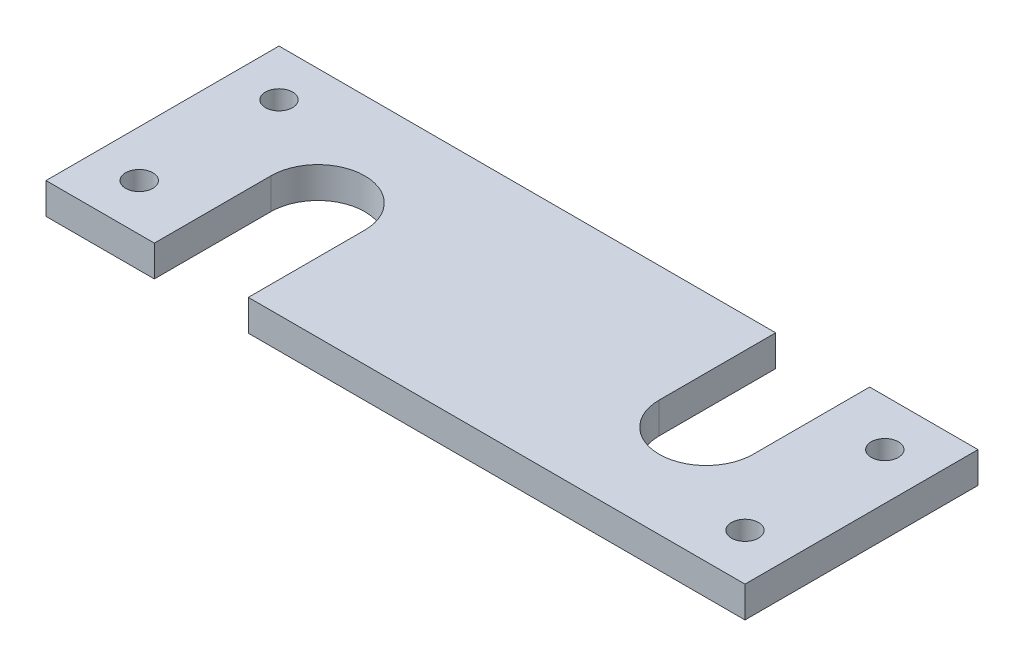
ISO-10303-21;
HEADER;
FILE_DESCRIPTION(('STEP AP214'),'2;1');
FILE_NAME('part.step','',(''),(''),'','','');
FILE_SCHEMA(('AUTOMOTIVE_DESIGN { 1 0 10303 214 1 1 1 1 }'));
ENDSEC;
DATA;
#1=APPLICATION_CONTEXT('core data for automotive mechanical design processes');
#2=APPLICATION_PROTOCOL_DEFINITION('international standard','automotive_design',2000,#1);
#3=PRODUCT_CONTEXT('',#1,'mechanical');
#4=PRODUCT('Part','Part','',(#3));
#5=PRODUCT_RELATED_PRODUCT_CATEGORY('part','',(#4));
#6=PRODUCT_DEFINITION_FORMATION('','',#4);
#7=PRODUCT_DEFINITION_CONTEXT('part definition',#1,'design');
#8=PRODUCT_DEFINITION('design','',#6,#7);
#9=PRODUCT_DEFINITION_SHAPE('','',#8);
#10=(LENGTH_UNIT() NAMED_UNIT(*) SI_UNIT(.MILLI.,.METRE.));
#11=(NAMED_UNIT(*) PLANE_ANGLE_UNIT() SI_UNIT($,.RADIAN.));
#12=(NAMED_UNIT(*) SI_UNIT($,.STERADIAN.) SOLID_ANGLE_UNIT());
#13=UNCERTAINTY_MEASURE_WITH_UNIT(LENGTH_MEASURE(1.E-05),#10,'distance_accuracy_value','');
#14=(GEOMETRIC_REPRESENTATION_CONTEXT(3) GLOBAL_UNCERTAINTY_ASSIGNED_CONTEXT((#13)) GLOBAL_UNIT_ASSIGNED_CONTEXT((#10,
#11,#12)) REPRESENTATION_CONTEXT('',''));
#15=CARTESIAN_POINT('',(0.,0.,0.));
#16=DIRECTION('',(0.,0.,1.));
#17=DIRECTION('',(1.,0.,0.));
#18=AXIS2_PLACEMENT_3D('',#15,#16,#17);
#19=CARTESIAN_POINT('',(0.,4.,-30.));
#20=DIRECTION('',(0.,0.,1.));
#21=DIRECTION('',(1.,0.,0.));
#22=AXIS2_PLACEMENT_3D('',#19,#20,#21);
#23=PLANE('',#22);
#24=DIRECTION('',(-1.,0.,0.));
#25=VECTOR('',#24,1.);
#26=CARTESIAN_POINT('',(0.,0.,-30.));
#27=LINE('',#26,#25);
#28=CARTESIAN_POINT('',(90.,0.,-30.));
#29=VERTEX_POINT('',#28);
#30=CARTESIAN_POINT('',(76.05,0.,-30.));
#31=VERTEX_POINT('',#30);
#32=EDGE_CURVE('E147',#29,#31,#27,.T.);
#33=ORIENTED_EDGE('',*,*,#32,.T.);
#34=DIRECTION('',(0.,1.,0.));
#35=VECTOR('',#34,1.);
#36=CARTESIAN_POINT('',(76.05,0.,-30.));
#37=LINE('',#36,#35);
#38=CARTESIAN_POINT('',(76.05,4.,-30.));
#39=VERTEX_POINT('',#38);
#40=EDGE_CURVE('E187',#31,#39,#37,.T.);
#41=ORIENTED_EDGE('',*,*,#40,.T.);
#42=DIRECTION('',(-1.,0.,0.));
#43=VECTOR('',#42,1.);
#44=CARTESIAN_POINT('',(0.,4.,-30.));
#45=LINE('',#44,#43);
#46=CARTESIAN_POINT('',(90.,4.,-30.));
#47=VERTEX_POINT('',#46);
#48=EDGE_CURVE('E169',#47,#39,#45,.T.);
#49=ORIENTED_EDGE('',*,*,#48,.F.);
#50=DIRECTION('',(0.,-1.,0.));
#51=VECTOR('',#50,1.);
#52=CARTESIAN_POINT('',(90.,4.,-30.));
#53=LINE('',#52,#51);
#54=EDGE_CURVE('E43',#47,#29,#53,.T.);
#55=ORIENTED_EDGE('',*,*,#54,.T.);
#56=EDGE_LOOP('',(#33,#41,#49,#55));
#57=FACE_BOUND('',#56,.T.);
#58=ADVANCED_FACE('F35',(#57),#23,.F.);
#59=CARTESIAN_POINT('',(0.,4.,0.));
#60=DIRECTION('',(0.,0.,-1.));
#61=DIRECTION('',(-1.,0.,0.));
#62=AXIS2_PLACEMENT_3D('',#59,#60,#61);
#63=PLANE('',#62);
#64=DIRECTION('',(1.,0.,0.));
#65=VECTOR('',#64,1.);
#66=CARTESIAN_POINT('',(0.,0.,0.));
#67=LINE('',#66,#65);
#68=CARTESIAN_POINT('',(0.,0.,0.));
#69=VERTEX_POINT('',#68);
#70=CARTESIAN_POINT('',(13.95,0.,0.));
#71=VERTEX_POINT('',#70);
#72=EDGE_CURVE('E151',#69,#71,#67,.T.);
#73=ORIENTED_EDGE('',*,*,#72,.T.);
#74=DIRECTION('',(0.,1.,0.));
#75=VECTOR('',#74,1.);
#76=CARTESIAN_POINT('',(13.95,0.,0.));
#77=LINE('',#76,#75);
#78=CARTESIAN_POINT('',(13.95,4.,0.));
#79=VERTEX_POINT('',#78);
#80=EDGE_CURVE('E201',#71,#79,#77,.T.);
#81=ORIENTED_EDGE('',*,*,#80,.T.);
#82=DIRECTION('',(1.,0.,0.));
#83=VECTOR('',#82,1.);
#84=CARTESIAN_POINT('',(0.,4.,0.));
#85=LINE('',#84,#83);
#86=CARTESIAN_POINT('',(0.,4.,0.));
#87=VERTEX_POINT('',#86);
#88=EDGE_CURVE('E217',#87,#79,#85,.T.);
#89=ORIENTED_EDGE('',*,*,#88,.F.);
#90=DIRECTION('',(0.,-1.,0.));
#91=VECTOR('',#90,1.);
#92=CARTESIAN_POINT('',(0.,4.,0.));
#93=LINE('',#92,#91);
#94=EDGE_CURVE('E157',#87,#69,#93,.T.);
#95=ORIENTED_EDGE('',*,*,#94,.T.);
#96=EDGE_LOOP('',(#73,#81,#89,#95));
#97=FACE_BOUND('',#96,.T.);
#98=ADVANCED_FACE('F242',(#97),#63,.F.);
#99=CARTESIAN_POINT('',(26.05,4.,0.));
#100=VERTEX_POINT('',#99);
#101=CARTESIAN_POINT('',(90.,4.,0.));
#102=VERTEX_POINT('',#101);
#103=EDGE_CURVE('E156',#100,#102,#85,.T.);
#104=ORIENTED_EDGE('',*,*,#103,.F.);
#105=DIRECTION('',(0.,1.,0.));
#106=VECTOR('',#105,1.);
#107=CARTESIAN_POINT('',(26.05,0.,0.));
#108=LINE('',#107,#106);
#109=CARTESIAN_POINT('',(26.05,0.,0.));
#110=VERTEX_POINT('',#109);
#111=EDGE_CURVE('E213',#110,#100,#108,.T.);
#112=ORIENTED_EDGE('',*,*,#111,.F.);
#113=CARTESIAN_POINT('',(90.,0.,0.));
#114=VERTEX_POINT('',#113);
#115=EDGE_CURVE('E210',#110,#114,#67,.T.);
#116=ORIENTED_EDGE('',*,*,#115,.T.);
#117=DIRECTION('',(0.,-1.,0.));
#118=VECTOR('',#117,1.);
#119=CARTESIAN_POINT('',(90.,4.,0.));
#120=LINE('',#119,#118);
#121=EDGE_CURVE('E11',#102,#114,#120,.T.);
#122=ORIENTED_EDGE('',*,*,#121,.F.);
#123=EDGE_LOOP('',(#104,#112,#116,#122));
#124=FACE_BOUND('',#123,.T.);
#125=ADVANCED_FACE('F37',(#124),#63,.F.);
#126=CARTESIAN_POINT('',(90.,4.,0.));
#127=DIRECTION('',(-1.,0.,0.));
#128=DIRECTION('',(0.,0.,1.));
#129=AXIS2_PLACEMENT_3D('',#126,#127,#128);
#130=PLANE('',#129);
#131=DIRECTION('',(0.,0.,-1.));
#132=VECTOR('',#131,1.);
#133=CARTESIAN_POINT('',(90.,0.,0.));
#134=LINE('',#133,#132);
#135=EDGE_CURVE('E148',#114,#29,#134,.T.);
#136=ORIENTED_EDGE('',*,*,#135,.T.);
#137=ORIENTED_EDGE('',*,*,#54,.F.);
#138=DIRECTION('',(0.,0.,-1.));
#139=VECTOR('',#138,1.);
#140=CARTESIAN_POINT('',(90.,4.,0.));
#141=LINE('',#140,#139);
#142=EDGE_CURVE('E220',#102,#47,#141,.T.);
#143=ORIENTED_EDGE('',*,*,#142,.F.);
#144=ORIENTED_EDGE('',*,*,#121,.T.);
#145=EDGE_LOOP('',(#136,#137,#143,#144));
#146=FACE_BOUND('',#145,.T.);
#147=ADVANCED_FACE('F250',(#146),#130,.F.);
#148=CARTESIAN_POINT('',(63.95,4.,-30.));
#149=VERTEX_POINT('',#148);
#150=CARTESIAN_POINT('',(0.,4.,-30.));
#151=VERTEX_POINT('',#150);
#152=EDGE_CURVE('E140',#149,#151,#45,.T.);
#153=ORIENTED_EDGE('',*,*,#152,.F.);
#154=DIRECTION('',(0.,1.,0.));
#155=VECTOR('',#154,1.);
#156=CARTESIAN_POINT('',(63.95,0.,-30.));
#157=LINE('',#156,#155);
#158=CARTESIAN_POINT('',(63.95,0.,-30.));
#159=VERTEX_POINT('',#158);
#160=EDGE_CURVE('E127',#159,#149,#157,.T.);
#161=ORIENTED_EDGE('',*,*,#160,.F.);
#162=CARTESIAN_POINT('',(0.,0.,-30.));
#163=VERTEX_POINT('',#162);
#164=EDGE_CURVE('E138',#159,#163,#27,.T.);
#165=ORIENTED_EDGE('',*,*,#164,.T.);
#166=DIRECTION('',(0.,-1.,0.));
#167=VECTOR('',#166,1.);
#168=CARTESIAN_POINT('',(0.,4.,-30.));
#169=LINE('',#168,#167);
#170=EDGE_CURVE('E160',#151,#163,#169,.T.);
#171=ORIENTED_EDGE('',*,*,#170,.F.);
#172=EDGE_LOOP('',(#153,#161,#165,#171));
#173=FACE_BOUND('',#172,.T.);
#174=ADVANCED_FACE('F136',(#173),#23,.F.);
#175=CARTESIAN_POINT('',(0.,4.,0.));
#176=DIRECTION('',(1.,0.,0.));
#177=DIRECTION('',(0.,0.,-1.));
#178=AXIS2_PLACEMENT_3D('',#175,#176,#177);
#179=PLANE('',#178);
#180=DIRECTION('',(0.,0.,1.));
#181=VECTOR('',#180,1.);
#182=CARTESIAN_POINT('',(0.,0.,0.));
#183=LINE('',#182,#181);
#184=EDGE_CURVE('E146',#163,#69,#183,.T.);
#185=ORIENTED_EDGE('',*,*,#184,.T.);
#186=ORIENTED_EDGE('',*,*,#94,.F.);
#187=DIRECTION('',(0.,0.,1.));
#188=VECTOR('',#187,1.);
#189=CARTESIAN_POINT('',(0.,4.,0.));
#190=LINE('',#189,#188);
#191=EDGE_CURVE('E161',#151,#87,#190,.T.);
#192=ORIENTED_EDGE('',*,*,#191,.F.);
#193=ORIENTED_EDGE('',*,*,#170,.T.);
#194=EDGE_LOOP('',(#185,#186,#192,#193));
#195=FACE_BOUND('',#194,.T.);
#196=ADVANCED_FACE('F246',(#195),#179,.F.);
#197=CARTESIAN_POINT('',(0.,4.,0.));
#198=DIRECTION('',(0.,1.,0.));
#199=DIRECTION('',(0.,0.,1.));
#200=AXIS2_PLACEMENT_3D('',#197,#198,#199);
#201=PLANE('',#200);
#202=CARTESIAN_POINT('',(84.,4.,-6.));
#203=DIRECTION('',(0.,1.,0.));
#204=DIRECTION('',(0.,0.,1.));
#205=AXIS2_PLACEMENT_3D('',#202,#203,#204);
#206=CIRCLE('',#205,1.75);
#207=CARTESIAN_POINT('',(84.,4.,-4.25));
#208=VERTEX_POINT('',#207);
#209=EDGE_CURVE('E305',#208,#208,#206,.T.);
#210=ORIENTED_EDGE('',*,*,#209,.F.);
#211=EDGE_LOOP('',(#210));
#212=FACE_BOUND('',#211,.T.);
#213=CARTESIAN_POINT('',(84.,4.,-24.));
#214=DIRECTION('',(0.,1.,0.));
#215=DIRECTION('',(0.,0.,1.));
#216=AXIS2_PLACEMENT_3D('',#213,#214,#215);
#217=CIRCLE('',#216,1.75);
#218=CARTESIAN_POINT('',(84.,4.,-22.25));
#219=VERTEX_POINT('',#218);
#220=EDGE_CURVE('E307',#219,#219,#217,.T.);
#221=ORIENTED_EDGE('',*,*,#220,.F.);
#222=EDGE_LOOP('',(#221));
#223=FACE_BOUND('',#222,.T.);
#224=CARTESIAN_POINT('',(6.00000000000001,4.,-24.));
#225=DIRECTION('',(0.,1.,0.));
#226=DIRECTION('',(0.,0.,1.));
#227=AXIS2_PLACEMENT_3D('',#224,#225,#226);
#228=CIRCLE('',#227,1.75);
#229=CARTESIAN_POINT('',(6.00000000000001,4.,-22.25));
#230=VERTEX_POINT('',#229);
#231=EDGE_CURVE('E313',#230,#230,#228,.T.);
#232=ORIENTED_EDGE('',*,*,#231,.F.);
#233=EDGE_LOOP('',(#232));
#234=FACE_BOUND('',#233,.T.);
#235=CARTESIAN_POINT('',(6.,4.,-6.));
#236=DIRECTION('',(0.,1.,0.));
#237=DIRECTION('',(0.,0.,1.));
#238=AXIS2_PLACEMENT_3D('',#235,#236,#237);
#239=CIRCLE('',#238,1.75);
#240=CARTESIAN_POINT('',(6.,4.,-4.25));
#241=VERTEX_POINT('',#240);
#242=EDGE_CURVE('E319',#241,#241,#239,.T.);
#243=ORIENTED_EDGE('',*,*,#242,.F.);
#244=EDGE_LOOP('',(#243));
#245=FACE_BOUND('',#244,.T.);
#246=DIRECTION('',(0.,0.,-1.));
#247=VECTOR('',#246,1.);
#248=CARTESIAN_POINT('',(76.05,4.,-15.));
#249=LINE('',#248,#247);
#250=CARTESIAN_POINT('',(76.05,4.,-15.));
#251=VERTEX_POINT('',#250);
#252=EDGE_CURVE('E132',#251,#39,#249,.T.);
#253=ORIENTED_EDGE('',*,*,#252,.F.);
#254=CARTESIAN_POINT('',(70.,4.,-15.));
#255=DIRECTION('',(0.,1.,0.));
#256=DIRECTION('',(0.,0.,1.));
#257=AXIS2_PLACEMENT_3D('',#254,#255,#256);
#258=CIRCLE('',#257,6.05000000000001);
#259=CARTESIAN_POINT('',(63.95,4.,-15.));
#260=VERTEX_POINT('',#259);
#261=EDGE_CURVE('E182',#260,#251,#258,.T.);
#262=ORIENTED_EDGE('',*,*,#261,.F.);
#263=DIRECTION('',(0.,0.,1.));
#264=VECTOR('',#263,1.);
#265=CARTESIAN_POINT('',(63.95,4.,-30.));
#266=LINE('',#265,#264);
#267=EDGE_CURVE('E180',#149,#260,#266,.T.);
#268=ORIENTED_EDGE('',*,*,#267,.F.);
#269=ORIENTED_EDGE('',*,*,#152,.T.);
#270=ORIENTED_EDGE('',*,*,#191,.T.);
#271=ORIENTED_EDGE('',*,*,#88,.T.);
#272=DIRECTION('',(0.,0.,1.));
#273=VECTOR('',#272,1.);
#274=CARTESIAN_POINT('',(13.95,4.,-15.));
#275=LINE('',#274,#273);
#276=CARTESIAN_POINT('',(13.95,4.,-15.));
#277=VERTEX_POINT('',#276);
#278=EDGE_CURVE('E189',#277,#79,#275,.T.);
#279=ORIENTED_EDGE('',*,*,#278,.F.);
#280=CARTESIAN_POINT('',(20.,4.,-15.));
#281=DIRECTION('',(0.,1.,0.));
#282=DIRECTION('',(0.,0.,-1.));
#283=AXIS2_PLACEMENT_3D('',#280,#281,#282);
#284=CIRCLE('',#283,6.05);
#285=CARTESIAN_POINT('',(26.05,4.,-15.));
#286=VERTEX_POINT('',#285);
#287=EDGE_CURVE('E197',#286,#277,#284,.T.);
#288=ORIENTED_EDGE('',*,*,#287,.F.);
#289=DIRECTION('',(0.,0.,-1.));
#290=VECTOR('',#289,1.);
#291=CARTESIAN_POINT('',(26.05,4.,0.));
#292=LINE('',#291,#290);
#293=EDGE_CURVE('E203',#100,#286,#292,.T.);
#294=ORIENTED_EDGE('',*,*,#293,.F.);
#295=ORIENTED_EDGE('',*,*,#103,.T.);
#296=ORIENTED_EDGE('',*,*,#142,.T.);
#297=ORIENTED_EDGE('',*,*,#48,.T.);
#298=EDGE_LOOP('',(#253,#262,#268,#269,#270,#271,#279,#288,#294,#295,#296,#297));
#299=FACE_BOUND('',#298,.T.);
#300=ADVANCED_FACE('F238',(#212,#223,#234,#245,#299),#201,.T.);
#301=CARTESIAN_POINT('',(0.,0.,0.));
#302=DIRECTION('',(0.,1.,0.));
#303=DIRECTION('',(0.,0.,1.));
#304=AXIS2_PLACEMENT_3D('',#301,#302,#303);
#305=PLANE('',#304);
#306=CARTESIAN_POINT('',(84.,0.,-6.));
#307=DIRECTION('',(0.,1.,0.));
#308=DIRECTION('',(0.,0.,1.));
#309=AXIS2_PLACEMENT_3D('',#306,#307,#308);
#310=CIRCLE('',#309,1.75);
#311=CARTESIAN_POINT('',(84.,0.,-4.25));
#312=VERTEX_POINT('',#311);
#313=EDGE_CURVE('E302',#312,#312,#310,.T.);
#314=ORIENTED_EDGE('',*,*,#313,.T.);
#315=EDGE_LOOP('',(#314));
#316=FACE_BOUND('',#315,.T.);
#317=CARTESIAN_POINT('',(84.,0.,-24.));
#318=DIRECTION('',(0.,1.,0.));
#319=DIRECTION('',(0.,0.,1.));
#320=AXIS2_PLACEMENT_3D('',#317,#318,#319);
#321=CIRCLE('',#320,1.75);
#322=CARTESIAN_POINT('',(84.,0.,-22.25));
#323=VERTEX_POINT('',#322);
#324=EDGE_CURVE('E310',#323,#323,#321,.T.);
#325=ORIENTED_EDGE('',*,*,#324,.T.);
#326=EDGE_LOOP('',(#325));
#327=FACE_BOUND('',#326,.T.);
#328=CARTESIAN_POINT('',(6.00000000000001,0.,-24.));
#329=DIRECTION('',(0.,1.,0.));
#330=DIRECTION('',(0.,0.,1.));
#331=AXIS2_PLACEMENT_3D('',#328,#329,#330);
#332=CIRCLE('',#331,1.75);
#333=CARTESIAN_POINT('',(6.00000000000001,0.,-22.25));
#334=VERTEX_POINT('',#333);
#335=EDGE_CURVE('E316',#334,#334,#332,.T.);
#336=ORIENTED_EDGE('',*,*,#335,.T.);
#337=EDGE_LOOP('',(#336));
#338=FACE_BOUND('',#337,.T.);
#339=CARTESIAN_POINT('',(6.,0.,-6.));
#340=DIRECTION('',(0.,1.,0.));
#341=DIRECTION('',(0.,0.,1.));
#342=AXIS2_PLACEMENT_3D('',#339,#340,#341);
#343=CIRCLE('',#342,1.75);
#344=CARTESIAN_POINT('',(6.,0.,-4.25));
#345=VERTEX_POINT('',#344);
#346=EDGE_CURVE('E183',#345,#345,#343,.T.);
#347=ORIENTED_EDGE('',*,*,#346,.T.);
#348=EDGE_LOOP('',(#347));
#349=FACE_BOUND('',#348,.T.);
#350=CARTESIAN_POINT('',(70.,0.,-15.));
#351=DIRECTION('',(0.,1.,0.));
#352=DIRECTION('',(0.,0.,1.));
#353=AXIS2_PLACEMENT_3D('',#350,#351,#352);
#354=CIRCLE('',#353,6.05000000000001);
#355=CARTESIAN_POINT('',(63.95,0.,-15.));
#356=VERTEX_POINT('',#355);
#357=CARTESIAN_POINT('',(76.05,0.,-15.));
#358=VERTEX_POINT('',#357);
#359=EDGE_CURVE('E50',#356,#358,#354,.T.);
#360=ORIENTED_EDGE('',*,*,#359,.T.);
#361=DIRECTION('',(0.,0.,-1.));
#362=VECTOR('',#361,1.);
#363=CARTESIAN_POINT('',(76.05,0.,-15.));
#364=LINE('',#363,#362);
#365=EDGE_CURVE('E141',#358,#31,#364,.T.);
#366=ORIENTED_EDGE('',*,*,#365,.T.);
#367=ORIENTED_EDGE('',*,*,#32,.F.);
#368=ORIENTED_EDGE('',*,*,#135,.F.);
#369=ORIENTED_EDGE('',*,*,#115,.F.);
#370=DIRECTION('',(0.,0.,-1.));
#371=VECTOR('',#370,1.);
#372=CARTESIAN_POINT('',(26.05,0.,0.));
#373=LINE('',#372,#371);
#374=CARTESIAN_POINT('',(26.05,0.,-15.));
#375=VERTEX_POINT('',#374);
#376=EDGE_CURVE('E196',#110,#375,#373,.T.);
#377=ORIENTED_EDGE('',*,*,#376,.T.);
#378=CARTESIAN_POINT('',(20.,0.,-15.));
#379=DIRECTION('',(0.,1.,0.));
#380=DIRECTION('',(0.,0.,-1.));
#381=AXIS2_PLACEMENT_3D('',#378,#379,#380);
#382=CIRCLE('',#381,6.05);
#383=CARTESIAN_POINT('',(13.95,0.,-15.));
#384=VERTEX_POINT('',#383);
#385=EDGE_CURVE('E58',#375,#384,#382,.T.);
#386=ORIENTED_EDGE('',*,*,#385,.T.);
#387=DIRECTION('',(0.,0.,1.));
#388=VECTOR('',#387,1.);
#389=CARTESIAN_POINT('',(13.95,0.,-15.));
#390=LINE('',#389,#388);
#391=EDGE_CURVE('E193',#384,#71,#390,.T.);
#392=ORIENTED_EDGE('',*,*,#391,.T.);
#393=ORIENTED_EDGE('',*,*,#72,.F.);
#394=ORIENTED_EDGE('',*,*,#184,.F.);
#395=ORIENTED_EDGE('',*,*,#164,.F.);
#396=DIRECTION('',(0.,0.,1.));
#397=VECTOR('',#396,1.);
#398=CARTESIAN_POINT('',(63.95,0.,-30.));
#399=LINE('',#398,#397);
#400=EDGE_CURVE('E123',#159,#356,#399,.T.);
#401=ORIENTED_EDGE('',*,*,#400,.T.);
#402=EDGE_LOOP('',(#360,#366,#367,#368,#369,#377,#386,#392,#393,#394,#395,#401));
#403=FACE_BOUND('',#402,.T.);
#404=ADVANCED_FACE('F144',(#316,#327,#338,#349,#403),#305,.F.);
#405=CARTESIAN_POINT('',(13.95,0.,-15.));
#406=DIRECTION('',(-1.,0.,0.));
#407=DIRECTION('',(0.,0.,1.));
#408=AXIS2_PLACEMENT_3D('',#405,#406,#407);
#409=PLANE('',#408);
#410=ORIENTED_EDGE('',*,*,#278,.T.);
#411=ORIENTED_EDGE('',*,*,#80,.F.);
#412=ORIENTED_EDGE('',*,*,#391,.F.);
#413=DIRECTION('',(0.,1.,0.));
#414=VECTOR('',#413,1.);
#415=CARTESIAN_POINT('',(13.95,0.,-15.));
#416=LINE('',#415,#414);
#417=EDGE_CURVE('E208',#384,#277,#416,.T.);
#418=ORIENTED_EDGE('',*,*,#417,.T.);
#419=EDGE_LOOP('',(#410,#411,#412,#418));
#420=FACE_BOUND('',#419,.T.);
#421=ADVANCED_FACE('F241',(#420),#409,.F.);
#422=CARTESIAN_POINT('',(20.,0.,-15.));
#423=DIRECTION('',(0.,1.,0.));
#424=DIRECTION('',(0.,0.,1.));
#425=AXIS2_PLACEMENT_3D('',#422,#423,#424);
#426=CYLINDRICAL_SURFACE('',#425,6.05);
#427=ORIENTED_EDGE('',*,*,#287,.T.);
#428=ORIENTED_EDGE('',*,*,#417,.F.);
#429=ORIENTED_EDGE('',*,*,#385,.F.);
#430=DIRECTION('',(0.,1.,0.));
#431=VECTOR('',#430,1.);
#432=CARTESIAN_POINT('',(26.05,0.,-15.));
#433=LINE('',#432,#431);
#434=EDGE_CURVE('E211',#375,#286,#433,.T.);
#435=ORIENTED_EDGE('',*,*,#434,.T.);
#436=EDGE_LOOP('',(#427,#428,#429,#435));
#437=FACE_BOUND('',#436,.T.);
#438=ADVANCED_FACE('F233',(#437),#426,.F.);
#439=CARTESIAN_POINT('',(26.05,0.,0.));
#440=DIRECTION('',(1.,0.,0.));
#441=DIRECTION('',(0.,0.,-1.));
#442=AXIS2_PLACEMENT_3D('',#439,#440,#441);
#443=PLANE('',#442);
#444=ORIENTED_EDGE('',*,*,#293,.T.);
#445=ORIENTED_EDGE('',*,*,#434,.F.);
#446=ORIENTED_EDGE('',*,*,#376,.F.);
#447=ORIENTED_EDGE('',*,*,#111,.T.);
#448=EDGE_LOOP('',(#444,#445,#446,#447));
#449=FACE_BOUND('',#448,.T.);
#450=ADVANCED_FACE('F230',(#449),#443,.F.);
#451=CARTESIAN_POINT('',(76.05,0.,-15.));
#452=DIRECTION('',(1.,0.,0.));
#453=DIRECTION('',(0.,0.,-1.));
#454=AXIS2_PLACEMENT_3D('',#451,#452,#453);
#455=PLANE('',#454);
#456=ORIENTED_EDGE('',*,*,#252,.T.);
#457=ORIENTED_EDGE('',*,*,#40,.F.);
#458=ORIENTED_EDGE('',*,*,#365,.F.);
#459=DIRECTION('',(0.,1.,0.));
#460=VECTOR('',#459,1.);
#461=CARTESIAN_POINT('',(76.05,0.,-15.));
#462=LINE('',#461,#460);
#463=EDGE_CURVE('E190',#358,#251,#462,.T.);
#464=ORIENTED_EDGE('',*,*,#463,.T.);
#465=EDGE_LOOP('',(#456,#457,#458,#464));
#466=FACE_BOUND('',#465,.T.);
#467=ADVANCED_FACE('F249',(#466),#455,.F.);
#468=CARTESIAN_POINT('',(70.,0.,-15.));
#469=DIRECTION('',(0.,1.,0.));
#470=DIRECTION('',(0.,0.,1.));
#471=AXIS2_PLACEMENT_3D('',#468,#469,#470);
#472=CYLINDRICAL_SURFACE('',#471,6.05000000000001);
#473=ORIENTED_EDGE('',*,*,#261,.T.);
#474=ORIENTED_EDGE('',*,*,#463,.F.);
#475=ORIENTED_EDGE('',*,*,#359,.F.);
#476=DIRECTION('',(0.,1.,0.));
#477=VECTOR('',#476,1.);
#478=CARTESIAN_POINT('',(63.95,0.,-15.));
#479=LINE('',#478,#477);
#480=EDGE_CURVE('E129',#356,#260,#479,.T.);
#481=ORIENTED_EDGE('',*,*,#480,.T.);
#482=EDGE_LOOP('',(#473,#474,#475,#481));
#483=FACE_BOUND('',#482,.T.);
#484=ADVANCED_FACE('F248',(#483),#472,.F.);
#485=CARTESIAN_POINT('',(63.95,0.,-30.));
#486=DIRECTION('',(-1.,0.,0.));
#487=DIRECTION('',(0.,0.,1.));
#488=AXIS2_PLACEMENT_3D('',#485,#486,#487);
#489=PLANE('',#488);
#490=ORIENTED_EDGE('',*,*,#267,.T.);
#491=ORIENTED_EDGE('',*,*,#480,.F.);
#492=ORIENTED_EDGE('',*,*,#400,.F.);
#493=ORIENTED_EDGE('',*,*,#160,.T.);
#494=EDGE_LOOP('',(#490,#491,#492,#493));
#495=FACE_BOUND('',#494,.T.);
#496=ADVANCED_FACE('F126',(#495),#489,.F.);
#497=CARTESIAN_POINT('',(6.,0.,-6.));
#498=DIRECTION('',(0.,1.,0.));
#499=DIRECTION('',(0.,0.,1.));
#500=AXIS2_PLACEMENT_3D('',#497,#498,#499);
#501=CYLINDRICAL_SURFACE('',#500,1.75);
#502=ORIENTED_EDGE('',*,*,#346,.F.);
#503=EDGE_LOOP('',(#502));
#504=FACE_BOUND('',#503,.T.);
#505=ORIENTED_EDGE('',*,*,#242,.T.);
#506=EDGE_LOOP('',(#505));
#507=FACE_BOUND('',#506,.T.);
#508=ADVANCED_FACE('F278',(#504,#507),#501,.F.);
#509=CARTESIAN_POINT('',(6.00000000000001,0.,-24.));
#510=DIRECTION('',(0.,1.,0.));
#511=DIRECTION('',(0.,0.,1.));
#512=AXIS2_PLACEMENT_3D('',#509,#510,#511);
#513=CYLINDRICAL_SURFACE('',#512,1.75);
#514=ORIENTED_EDGE('',*,*,#335,.F.);
#515=EDGE_LOOP('',(#514));
#516=FACE_BOUND('',#515,.T.);
#517=ORIENTED_EDGE('',*,*,#231,.T.);
#518=EDGE_LOOP('',(#517));
#519=FACE_BOUND('',#518,.T.);
#520=ADVANCED_FACE('F285',(#516,#519),#513,.F.);
#521=CARTESIAN_POINT('',(84.,0.,-24.));
#522=DIRECTION('',(0.,1.,0.));
#523=DIRECTION('',(0.,0.,1.));
#524=AXIS2_PLACEMENT_3D('',#521,#522,#523);
#525=CYLINDRICAL_SURFACE('',#524,1.75);
#526=ORIENTED_EDGE('',*,*,#324,.F.);
#527=EDGE_LOOP('',(#526));
#528=FACE_BOUND('',#527,.T.);
#529=ORIENTED_EDGE('',*,*,#220,.T.);
#530=EDGE_LOOP('',(#529));
#531=FACE_BOUND('',#530,.T.);
#532=ADVANCED_FACE('F289',(#528,#531),#525,.F.);
#533=CARTESIAN_POINT('',(84.,0.,-6.));
#534=DIRECTION('',(0.,1.,0.));
#535=DIRECTION('',(0.,0.,1.));
#536=AXIS2_PLACEMENT_3D('',#533,#534,#535);
#537=CYLINDRICAL_SURFACE('',#536,1.75);
#538=ORIENTED_EDGE('',*,*,#313,.F.);
#539=EDGE_LOOP('',(#538));
#540=FACE_BOUND('',#539,.T.);
#541=ORIENTED_EDGE('',*,*,#209,.T.);
#542=EDGE_LOOP('',(#541));
#543=FACE_BOUND('',#542,.T.);
#544=ADVANCED_FACE('F293',(#540,#543),#537,.F.);
#545=CLOSED_SHELL('',(#58,#98,#125,#147,#174,#196,#300,#404,#421,#438,#450,#467,#484,#496,#508,
#520,#532,#544));
#546=MANIFOLD_SOLID_BREP('B2',#545);
#547=ADVANCED_BREP_SHAPE_REPRESENTATION('',(#18,#546),#14);
#548=SHAPE_DEFINITION_REPRESENTATION(#9,#547);
ENDSEC;
END-ISO-10303-21;
